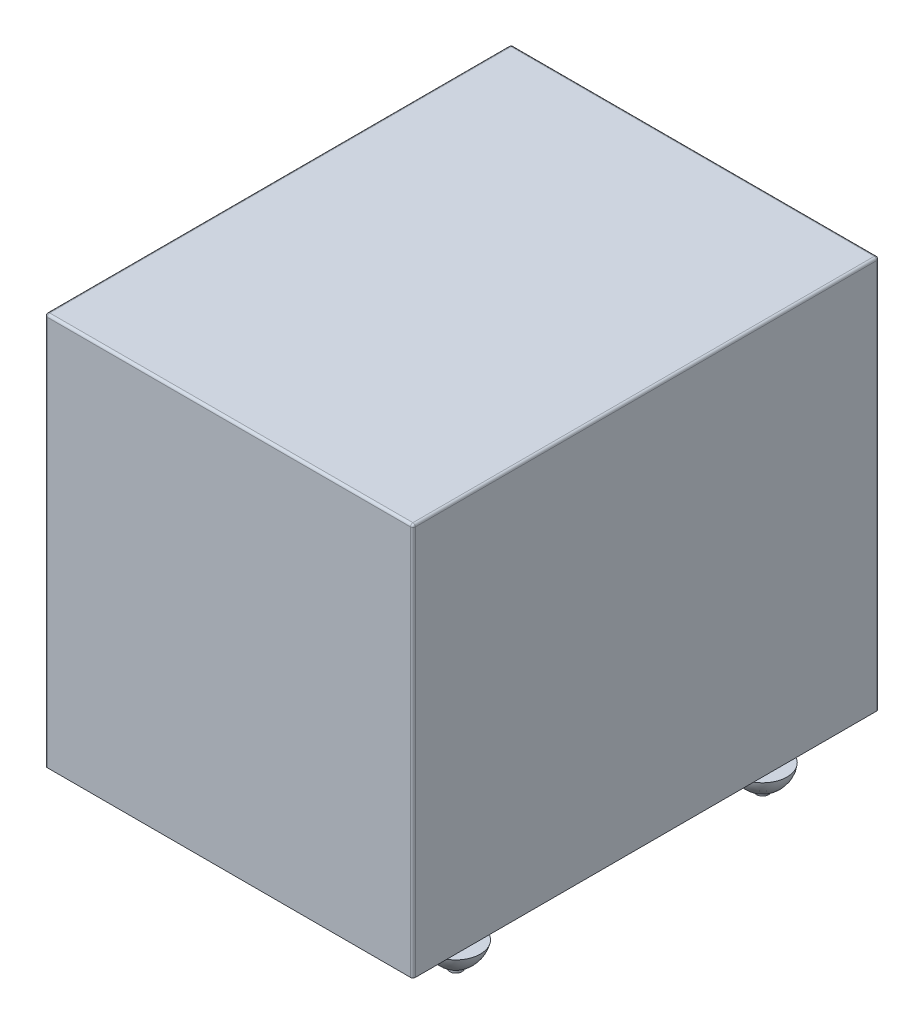
ISO-10303-21;
HEADER;
FILE_DESCRIPTION(('STEP AP214'),'2;1');
FILE_NAME('part.step','',(''),(''),'','','');
FILE_SCHEMA(('AUTOMOTIVE_DESIGN { 1 0 10303 214 1 1 1 1 }'));
ENDSEC;
DATA;
#1=APPLICATION_CONTEXT('core data for automotive mechanical design processes');
#2=APPLICATION_PROTOCOL_DEFINITION('international standard','automotive_design',2000,#1);
#3=PRODUCT_CONTEXT('',#1,'mechanical');
#4=PRODUCT('Part','Part','',(#3));
#5=PRODUCT_RELATED_PRODUCT_CATEGORY('part','',(#4));
#6=PRODUCT_DEFINITION_FORMATION('','',#4);
#7=PRODUCT_DEFINITION_CONTEXT('part definition',#1,'design');
#8=PRODUCT_DEFINITION('design','',#6,#7);
#9=PRODUCT_DEFINITION_SHAPE('','',#8);
#10=(LENGTH_UNIT() NAMED_UNIT(*) SI_UNIT(.MILLI.,.METRE.));
#11=(NAMED_UNIT(*) PLANE_ANGLE_UNIT() SI_UNIT($,.RADIAN.));
#12=(NAMED_UNIT(*) SI_UNIT($,.STERADIAN.) SOLID_ANGLE_UNIT());
#13=UNCERTAINTY_MEASURE_WITH_UNIT(LENGTH_MEASURE(1.E-05),#10,'distance_accuracy_value','');
#14=(GEOMETRIC_REPRESENTATION_CONTEXT(3) GLOBAL_UNCERTAINTY_ASSIGNED_CONTEXT((#13)) GLOBAL_UNIT_ASSIGNED_CONTEXT((#10,
#11,#12)) REPRESENTATION_CONTEXT('',''));
#15=CARTESIAN_POINT('',(0.,0.,0.));
#16=DIRECTION('',(0.,0.,1.));
#17=DIRECTION('',(1.,0.,0.));
#18=AXIS2_PLACEMENT_3D('',#15,#16,#17);
#19=CARTESIAN_POINT('',(6.,-2.,6.25));
#20=DIRECTION('',(0.,1.,0.));
#21=DIRECTION('',(0.,0.,1.));
#22=AXIS2_PLACEMENT_3D('',#19,#20,#21);
#23=CYLINDRICAL_SURFACE('',#22,0.25);
#24=CARTESIAN_POINT('',(6.,0.,6.25));
#25=DIRECTION('',(0.,1.,0.));
#26=DIRECTION('',(0.,0.,1.));
#27=AXIS2_PLACEMENT_3D('',#24,#25,#26);
#28=CIRCLE('',#27,0.25);
#29=CARTESIAN_POINT('',(6.,0.,6.5));
#30=VERTEX_POINT('',#29);
#31=EDGE_CURVE('E187',#30,#30,#28,.F.);
#32=ORIENTED_EDGE('',*,*,#31,.T.);
#33=EDGE_LOOP('',(#32));
#34=FACE_BOUND('',#33,.T.);
#35=CARTESIAN_POINT('',(6.,-1.,6.25));
#36=DIRECTION('',(0.,-1.,0.));
#37=DIRECTION('',(0.,0.,-1.));
#38=AXIS2_PLACEMENT_3D('',#35,#36,#37);
#39=CIRCLE('',#38,0.25);
#40=CARTESIAN_POINT('',(6.,-1.,6.));
#41=VERTEX_POINT('',#40);
#42=EDGE_CURVE('E41',#41,#41,#39,.T.);
#43=ORIENTED_EDGE('',*,*,#42,.F.);
#44=EDGE_LOOP('',(#43));
#45=FACE_BOUND('',#44,.T.);
#46=ADVANCED_FACE('F32',(#34,#45),#23,.T.);
#47=CARTESIAN_POINT('',(7.49999999999999,16.,-9.5));
#48=DIRECTION('',(-1.,0.,0.));
#49=DIRECTION('',(0.,0.,1.));
#50=AXIS2_PLACEMENT_3D('',#47,#48,#49);
#51=PLANE('',#50);
#52=DIRECTION('',(0.,0.,-1.));
#53=VECTOR('',#52,1.);
#54=CARTESIAN_POINT('',(7.49999999999999,0.,-9.5));
#55=LINE('',#54,#53);
#56=CARTESIAN_POINT('',(7.5,0.,9.4));
#57=VERTEX_POINT('',#56);
#58=CARTESIAN_POINT('',(7.49999999999999,0.,-9.4));
#59=VERTEX_POINT('',#58);
#60=EDGE_CURVE('E152',#57,#59,#55,.T.);
#61=ORIENTED_EDGE('',*,*,#60,.T.);
#62=DIRECTION('',(0.,-1.,0.));
#63=VECTOR('',#62,1.);
#64=CARTESIAN_POINT('',(7.49999999999999,16.,-9.4));
#65=LINE('',#64,#63);
#66=CARTESIAN_POINT('',(7.49999999999999,15.9,-9.4));
#67=VERTEX_POINT('',#66);
#68=EDGE_CURVE('E176',#59,#67,#65,.F.);
#69=ORIENTED_EDGE('',*,*,#68,.T.);
#70=DIRECTION('',(0.,0.,-1.));
#71=VECTOR('',#70,1.);
#72=CARTESIAN_POINT('',(7.5,15.9,9.5));
#73=LINE('',#72,#71);
#74=CARTESIAN_POINT('',(7.5,15.9,9.4));
#75=VERTEX_POINT('',#74);
#76=EDGE_CURVE('E172',#67,#75,#73,.F.);
#77=ORIENTED_EDGE('',*,*,#76,.T.);
#78=DIRECTION('',(0.,-1.,0.));
#79=VECTOR('',#78,1.);
#80=CARTESIAN_POINT('',(7.5,16.,9.4));
#81=LINE('',#80,#79);
#82=EDGE_CURVE('E174',#75,#57,#81,.T.);
#83=ORIENTED_EDGE('',*,*,#82,.T.);
#84=EDGE_LOOP('',(#61,#69,#77,#83));
#85=FACE_BOUND('',#84,.T.);
#86=ADVANCED_FACE('F364',(#85),#51,.F.);
#87=CARTESIAN_POINT('',(-7.5,16.,-9.5));
#88=DIRECTION('',(0.,0.,1.));
#89=DIRECTION('',(1.,0.,0.));
#90=AXIS2_PLACEMENT_3D('',#87,#88,#89);
#91=PLANE('',#90);
#92=DIRECTION('',(-1.,0.,0.));
#93=VECTOR('',#92,1.);
#94=CARTESIAN_POINT('',(-7.5,0.,-9.5));
#95=LINE('',#94,#93);
#96=CARTESIAN_POINT('',(7.39999999999999,0.,-9.5));
#97=VERTEX_POINT('',#96);
#98=CARTESIAN_POINT('',(-7.4,0.,-9.5));
#99=VERTEX_POINT('',#98);
#100=EDGE_CURVE('E148',#97,#99,#95,.T.);
#101=ORIENTED_EDGE('',*,*,#100,.T.);
#102=DIRECTION('',(0.,-1.,0.));
#103=VECTOR('',#102,1.);
#104=CARTESIAN_POINT('',(-7.4,16.,-9.5));
#105=LINE('',#104,#103);
#106=CARTESIAN_POINT('',(-7.4,15.9,-9.5));
#107=VERTEX_POINT('',#106);
#108=EDGE_CURVE('E125',#99,#107,#105,.F.);
#109=ORIENTED_EDGE('',*,*,#108,.T.);
#110=DIRECTION('',(-1.,0.,0.));
#111=VECTOR('',#110,1.);
#112=CARTESIAN_POINT('',(7.49999999999999,15.9,-9.5));
#113=LINE('',#112,#111);
#114=CARTESIAN_POINT('',(7.39999999999999,15.9,-9.5));
#115=VERTEX_POINT('',#114);
#116=EDGE_CURVE('E130',#107,#115,#113,.F.);
#117=ORIENTED_EDGE('',*,*,#116,.T.);
#118=DIRECTION('',(0.,-1.,0.));
#119=VECTOR('',#118,1.);
#120=CARTESIAN_POINT('',(7.39999999999999,16.,-9.5));
#121=LINE('',#120,#119);
#122=EDGE_CURVE('E163',#115,#97,#121,.T.);
#123=ORIENTED_EDGE('',*,*,#122,.T.);
#124=EDGE_LOOP('',(#101,#109,#117,#123));
#125=FACE_BOUND('',#124,.T.);
#126=ADVANCED_FACE('F413',(#125),#91,.F.);
#127=CARTESIAN_POINT('',(-7.5,16.,-9.5));
#128=DIRECTION('',(1.,0.,0.));
#129=DIRECTION('',(0.,0.,-1.));
#130=AXIS2_PLACEMENT_3D('',#127,#128,#129);
#131=PLANE('',#130);
#132=DIRECTION('',(0.,0.,1.));
#133=VECTOR('',#132,1.);
#134=CARTESIAN_POINT('',(-7.5,15.9,-9.5));
#135=LINE('',#134,#133);
#136=CARTESIAN_POINT('',(-7.5,15.9,9.4));
#137=VERTEX_POINT('',#136);
#138=CARTESIAN_POINT('',(-7.5,15.9,-9.4));
#139=VERTEX_POINT('',#138);
#140=EDGE_CURVE('E139',#137,#139,#135,.F.);
#141=ORIENTED_EDGE('',*,*,#140,.T.);
#142=DIRECTION('',(0.,-1.,0.));
#143=VECTOR('',#142,1.);
#144=CARTESIAN_POINT('',(-7.5,16.,-9.4));
#145=LINE('',#144,#143);
#146=CARTESIAN_POINT('',(-7.5,0.,-9.4));
#147=VERTEX_POINT('',#146);
#148=EDGE_CURVE('E124',#139,#147,#145,.T.);
#149=ORIENTED_EDGE('',*,*,#148,.T.);
#150=DIRECTION('',(0.,0.,1.));
#151=VECTOR('',#150,1.);
#152=CARTESIAN_POINT('',(-7.5,0.,-9.5));
#153=LINE('',#152,#151);
#154=CARTESIAN_POINT('',(-7.5,0.,9.4));
#155=VERTEX_POINT('',#154);
#156=EDGE_CURVE('E136',#147,#155,#153,.T.);
#157=ORIENTED_EDGE('',*,*,#156,.T.);
#158=DIRECTION('',(0.,-1.,0.));
#159=VECTOR('',#158,1.);
#160=CARTESIAN_POINT('',(-7.5,16.,9.4));
#161=LINE('',#160,#159);
#162=EDGE_CURVE('E142',#155,#137,#161,.F.);
#163=ORIENTED_EDGE('',*,*,#162,.T.);
#164=EDGE_LOOP('',(#141,#149,#157,#163));
#165=FACE_BOUND('',#164,.T.);
#166=ADVANCED_FACE('F135',(#165),#131,.F.);
#167=CARTESIAN_POINT('',(-7.5,16.,9.5));
#168=DIRECTION('',(0.,0.,-1.));
#169=DIRECTION('',(-1.,0.,0.));
#170=AXIS2_PLACEMENT_3D('',#167,#168,#169);
#171=PLANE('',#170);
#172=DIRECTION('',(1.,0.,0.));
#173=VECTOR('',#172,1.);
#174=CARTESIAN_POINT('',(-7.5,15.9,9.5));
#175=LINE('',#174,#173);
#176=CARTESIAN_POINT('',(7.4,15.9,9.5));
#177=VERTEX_POINT('',#176);
#178=CARTESIAN_POINT('',(-7.4,15.9,9.5));
#179=VERTEX_POINT('',#178);
#180=EDGE_CURVE('E166',#177,#179,#175,.F.);
#181=ORIENTED_EDGE('',*,*,#180,.T.);
#182=DIRECTION('',(0.,-1.,0.));
#183=VECTOR('',#182,1.);
#184=CARTESIAN_POINT('',(-7.4,16.,9.5));
#185=LINE('',#184,#183);
#186=CARTESIAN_POINT('',(-7.4,0.,9.5));
#187=VERTEX_POINT('',#186);
#188=EDGE_CURVE('E170',#179,#187,#185,.T.);
#189=ORIENTED_EDGE('',*,*,#188,.T.);
#190=DIRECTION('',(1.,0.,0.));
#191=VECTOR('',#190,1.);
#192=CARTESIAN_POINT('',(-7.5,0.,9.5));
#193=LINE('',#192,#191);
#194=CARTESIAN_POINT('',(7.4,0.,9.5));
#195=VERTEX_POINT('',#194);
#196=EDGE_CURVE('E147',#187,#195,#193,.T.);
#197=ORIENTED_EDGE('',*,*,#196,.T.);
#198=DIRECTION('',(0.,-1.,0.));
#199=VECTOR('',#198,1.);
#200=CARTESIAN_POINT('',(7.4,16.,9.5));
#201=LINE('',#200,#199);
#202=EDGE_CURVE('E168',#195,#177,#201,.F.);
#203=ORIENTED_EDGE('',*,*,#202,.T.);
#204=EDGE_LOOP('',(#181,#189,#197,#203));
#205=FACE_BOUND('',#204,.T.);
#206=ADVANCED_FACE('F395',(#205),#171,.F.);
#207=CARTESIAN_POINT('',(0.,16.,0.));
#208=DIRECTION('',(0.,1.,0.));
#209=DIRECTION('',(0.,0.,1.));
#210=AXIS2_PLACEMENT_3D('',#207,#208,#209);
#211=PLANE('',#210);
#212=DIRECTION('',(-1.,0.,0.));
#213=VECTOR('',#212,1.);
#214=CARTESIAN_POINT('',(-7.5,16.,-9.4));
#215=LINE('',#214,#213);
#216=CARTESIAN_POINT('',(7.39999999999999,16.,-9.4));
#217=VERTEX_POINT('',#216);
#218=CARTESIAN_POINT('',(-7.4,16.,-9.4));
#219=VERTEX_POINT('',#218);
#220=EDGE_CURVE('E182',#217,#219,#215,.T.);
#221=ORIENTED_EDGE('',*,*,#220,.T.);
#222=DIRECTION('',(0.,0.,1.));
#223=VECTOR('',#222,1.);
#224=CARTESIAN_POINT('',(-7.4,16.,9.5));
#225=LINE('',#224,#223);
#226=CARTESIAN_POINT('',(-7.4,16.,9.4));
#227=VERTEX_POINT('',#226);
#228=EDGE_CURVE('E184',#219,#227,#225,.T.);
#229=ORIENTED_EDGE('',*,*,#228,.T.);
#230=DIRECTION('',(1.,0.,0.));
#231=VECTOR('',#230,1.);
#232=CARTESIAN_POINT('',(7.5,16.,9.4));
#233=LINE('',#232,#231);
#234=CARTESIAN_POINT('',(7.4,16.,9.4));
#235=VERTEX_POINT('',#234);
#236=EDGE_CURVE('E178',#227,#235,#233,.T.);
#237=ORIENTED_EDGE('',*,*,#236,.T.);
#238=DIRECTION('',(0.,0.,-1.));
#239=VECTOR('',#238,1.);
#240=CARTESIAN_POINT('',(7.39999999999999,16.,-9.5));
#241=LINE('',#240,#239);
#242=EDGE_CURVE('E180',#235,#217,#241,.T.);
#243=ORIENTED_EDGE('',*,*,#242,.T.);
#244=EDGE_LOOP('',(#221,#229,#237,#243));
#245=FACE_BOUND('',#244,.T.);
#246=ADVANCED_FACE('F621',(#245),#211,.T.);
#247=CARTESIAN_POINT('',(0.,0.,0.));
#248=DIRECTION('',(0.,1.,0.));
#249=DIRECTION('',(0.,0.,1.));
#250=AXIS2_PLACEMENT_3D('',#247,#248,#249);
#251=PLANE('',#250);
#252=CARTESIAN_POINT('',(0.,0.,-8.25));
#253=DIRECTION('',(0.,1.,0.));
#254=DIRECTION('',(0.,0.,1.));
#255=AXIS2_PLACEMENT_3D('',#252,#253,#254);
#256=CIRCLE('',#255,0.25);
#257=CARTESIAN_POINT('',(0.,0.,-8.));
#258=VERTEX_POINT('',#257);
#259=EDGE_CURVE('E234',#258,#258,#256,.F.);
#260=ORIENTED_EDGE('',*,*,#259,.F.);
#261=EDGE_LOOP('',(#260));
#262=FACE_BOUND('',#261,.T.);
#263=CARTESIAN_POINT('',(-6.,0.,-6.25));
#264=DIRECTION('',(0.,1.,0.));
#265=DIRECTION('',(0.,0.,1.));
#266=AXIS2_PLACEMENT_3D('',#263,#264,#265);
#267=CIRCLE('',#266,0.250000000000002);
#268=CARTESIAN_POINT('',(-6.,0.,-6.));
#269=VERTEX_POINT('',#268);
#270=EDGE_CURVE('E231',#269,#269,#267,.F.);
#271=ORIENTED_EDGE('',*,*,#270,.F.);
#272=EDGE_LOOP('',(#271));
#273=FACE_BOUND('',#272,.T.);
#274=CARTESIAN_POINT('',(6.,0.,-6.25));
#275=DIRECTION('',(0.,1.,0.));
#276=DIRECTION('',(0.,0.,1.));
#277=AXIS2_PLACEMENT_3D('',#274,#275,#276);
#278=CIRCLE('',#277,0.249999999999999);
#279=CARTESIAN_POINT('',(6.,0.,-6.));
#280=VERTEX_POINT('',#279);
#281=EDGE_CURVE('E228',#280,#280,#278,.F.);
#282=ORIENTED_EDGE('',*,*,#281,.F.);
#283=EDGE_LOOP('',(#282));
#284=FACE_BOUND('',#283,.T.);
#285=CARTESIAN_POINT('',(-6.,0.,6.25));
#286=DIRECTION('',(0.,1.,0.));
#287=DIRECTION('',(0.,0.,1.));
#288=AXIS2_PLACEMENT_3D('',#285,#286,#287);
#289=CIRCLE('',#288,0.25);
#290=CARTESIAN_POINT('',(-6.,0.,6.5));
#291=VERTEX_POINT('',#290);
#292=EDGE_CURVE('E225',#291,#291,#289,.F.);
#293=ORIENTED_EDGE('',*,*,#292,.F.);
#294=EDGE_LOOP('',(#293));
#295=FACE_BOUND('',#294,.T.);
#296=ORIENTED_EDGE('',*,*,#31,.F.);
#297=EDGE_LOOP('',(#296));
#298=FACE_BOUND('',#297,.T.);
#299=ORIENTED_EDGE('',*,*,#156,.F.);
#300=CARTESIAN_POINT('',(-7.4,0.,-9.4));
#301=DIRECTION('',(0.,1.,0.));
#302=DIRECTION('',(0.,0.,1.));
#303=AXIS2_PLACEMENT_3D('',#300,#301,#302);
#304=CIRCLE('',#303,0.1);
#305=EDGE_CURVE('E120',#147,#99,#304,.F.);
#306=ORIENTED_EDGE('',*,*,#305,.T.);
#307=ORIENTED_EDGE('',*,*,#100,.F.);
#308=CARTESIAN_POINT('',(7.39999999999999,0.,-9.4));
#309=DIRECTION('',(0.,1.,0.));
#310=DIRECTION('',(0.,0.,1.));
#311=AXIS2_PLACEMENT_3D('',#308,#309,#310);
#312=CIRCLE('',#311,0.1);
#313=EDGE_CURVE('E159',#97,#59,#312,.F.);
#314=ORIENTED_EDGE('',*,*,#313,.T.);
#315=ORIENTED_EDGE('',*,*,#60,.F.);
#316=CARTESIAN_POINT('',(7.4,0.,9.4));
#317=DIRECTION('',(0.,1.,0.));
#318=DIRECTION('',(0.,0.,1.));
#319=AXIS2_PLACEMENT_3D('',#316,#317,#318);
#320=CIRCLE('',#319,0.1);
#321=EDGE_CURVE('E141',#57,#195,#320,.F.);
#322=ORIENTED_EDGE('',*,*,#321,.T.);
#323=ORIENTED_EDGE('',*,*,#196,.F.);
#324=CARTESIAN_POINT('',(-7.4,0.,9.4));
#325=DIRECTION('',(0.,1.,0.));
#326=DIRECTION('',(0.,0.,1.));
#327=AXIS2_PLACEMENT_3D('',#324,#325,#326);
#328=CIRCLE('',#327,0.1);
#329=EDGE_CURVE('E131',#187,#155,#328,.F.);
#330=ORIENTED_EDGE('',*,*,#329,.T.);
#331=EDGE_LOOP('',(#299,#306,#307,#314,#315,#322,#323,#330));
#332=FACE_BOUND('',#331,.T.);
#333=ADVANCED_FACE('F144',(#262,#273,#284,#295,#298,#332),#251,.F.);
#334=CARTESIAN_POINT('',(7.4,16.,9.4));
#335=DIRECTION('',(0.,-1.,0.));
#336=DIRECTION('',(0.,0.,-1.));
#337=AXIS2_PLACEMENT_3D('',#334,#335,#336);
#338=CYLINDRICAL_SURFACE('',#337,0.1);
#339=CARTESIAN_POINT('',(7.4,15.9,9.4));
#340=DIRECTION('',(0.,1.,0.));
#341=DIRECTION('',(0.,0.,1.));
#342=AXIS2_PLACEMENT_3D('',#339,#340,#341);
#343=CIRCLE('',#342,0.1);
#344=EDGE_CURVE('E220',#177,#75,#343,.T.);
#345=ORIENTED_EDGE('',*,*,#344,.F.);
#346=ORIENTED_EDGE('',*,*,#202,.F.);
#347=ORIENTED_EDGE('',*,*,#321,.F.);
#348=ORIENTED_EDGE('',*,*,#82,.F.);
#349=EDGE_LOOP('',(#345,#346,#347,#348));
#350=FACE_BOUND('',#349,.T.);
#351=ADVANCED_FACE('F34',(#350),#338,.T.);
#352=CARTESIAN_POINT('',(7.4,15.9,9.4));
#353=DIRECTION('',(0.,0.,1.));
#354=DIRECTION('',(1.,0.,0.));
#355=AXIS2_PLACEMENT_3D('',#352,#353,#354);
#356=SPHERICAL_SURFACE('',#355,0.1);
#357=CARTESIAN_POINT('',(7.4,15.9,9.4));
#358=DIRECTION('',(1.,0.,0.));
#359=DIRECTION('',(0.,0.,-1.));
#360=AXIS2_PLACEMENT_3D('',#357,#358,#359);
#361=CIRCLE('',#360,0.1);
#362=EDGE_CURVE('E214',#177,#235,#361,.F.);
#363=ORIENTED_EDGE('',*,*,#362,.F.);
#364=ORIENTED_EDGE('',*,*,#344,.T.);
#365=CARTESIAN_POINT('',(7.4,15.9,9.4));
#366=DIRECTION('',(0.,0.,1.));
#367=DIRECTION('',(1.,0.,0.));
#368=AXIS2_PLACEMENT_3D('',#365,#366,#367);
#369=CIRCLE('',#368,0.1);
#370=EDGE_CURVE('E217',#235,#75,#369,.F.);
#371=ORIENTED_EDGE('',*,*,#370,.F.);
#372=EDGE_LOOP('',(#363,#364,#371));
#373=FACE_BOUND('',#372,.T.);
#374=ADVANCED_FACE('F387',(#373),#356,.T.);
#375=CARTESIAN_POINT('',(7.39999999999999,16.,-9.4));
#376=DIRECTION('',(0.,-1.,0.));
#377=DIRECTION('',(0.,0.,-1.));
#378=AXIS2_PLACEMENT_3D('',#375,#376,#377);
#379=CYLINDRICAL_SURFACE('',#378,0.1);
#380=ORIENTED_EDGE('',*,*,#313,.F.);
#381=ORIENTED_EDGE('',*,*,#122,.F.);
#382=CARTESIAN_POINT('',(7.39999999999999,15.9,-9.4));
#383=DIRECTION('',(0.,1.,0.));
#384=DIRECTION('',(0.,0.,1.));
#385=AXIS2_PLACEMENT_3D('',#382,#383,#384);
#386=CIRCLE('',#385,0.1);
#387=EDGE_CURVE('E211',#67,#115,#386,.T.);
#388=ORIENTED_EDGE('',*,*,#387,.F.);
#389=ORIENTED_EDGE('',*,*,#68,.F.);
#390=EDGE_LOOP('',(#380,#381,#388,#389));
#391=FACE_BOUND('',#390,.T.);
#392=ADVANCED_FACE('F371',(#391),#379,.T.);
#393=CARTESIAN_POINT('',(7.4,15.9,0.));
#394=DIRECTION('',(0.,0.,1.));
#395=DIRECTION('',(1.,0.,0.));
#396=AXIS2_PLACEMENT_3D('',#393,#394,#395);
#397=CYLINDRICAL_SURFACE('',#396,0.1);
#398=ORIENTED_EDGE('',*,*,#370,.T.);
#399=ORIENTED_EDGE('',*,*,#76,.F.);
#400=CARTESIAN_POINT('',(7.39999999999999,15.9,-9.4));
#401=DIRECTION('',(0.,0.,-1.));
#402=DIRECTION('',(-1.,0.,0.));
#403=AXIS2_PLACEMENT_3D('',#400,#401,#402);
#404=CIRCLE('',#403,0.1);
#405=EDGE_CURVE('E208',#217,#67,#404,.T.);
#406=ORIENTED_EDGE('',*,*,#405,.F.);
#407=ORIENTED_EDGE('',*,*,#242,.F.);
#408=EDGE_LOOP('',(#398,#399,#406,#407));
#409=FACE_BOUND('',#408,.T.);
#410=ADVANCED_FACE('F380',(#409),#397,.T.);
#411=CARTESIAN_POINT('',(0.,15.9,9.4));
#412=DIRECTION('',(-1.,0.,0.));
#413=DIRECTION('',(0.,0.,1.));
#414=AXIS2_PLACEMENT_3D('',#411,#412,#413);
#415=CYLINDRICAL_SURFACE('',#414,0.1);
#416=ORIENTED_EDGE('',*,*,#362,.T.);
#417=ORIENTED_EDGE('',*,*,#236,.F.);
#418=CARTESIAN_POINT('',(-7.4,15.9,9.4));
#419=DIRECTION('',(-1.,0.,0.));
#420=DIRECTION('',(0.,0.,1.));
#421=AXIS2_PLACEMENT_3D('',#418,#419,#420);
#422=CIRCLE('',#421,0.1);
#423=EDGE_CURVE('E205',#179,#227,#422,.T.);
#424=ORIENTED_EDGE('',*,*,#423,.F.);
#425=ORIENTED_EDGE('',*,*,#180,.F.);
#426=EDGE_LOOP('',(#416,#417,#424,#425));
#427=FACE_BOUND('',#426,.T.);
#428=ADVANCED_FACE('F392',(#427),#415,.T.);
#429=CARTESIAN_POINT('',(-7.4,16.,9.4));
#430=DIRECTION('',(0.,-1.,0.));
#431=DIRECTION('',(0.,0.,-1.));
#432=AXIS2_PLACEMENT_3D('',#429,#430,#431);
#433=CYLINDRICAL_SURFACE('',#432,0.1);
#434=ORIENTED_EDGE('',*,*,#329,.F.);
#435=ORIENTED_EDGE('',*,*,#188,.F.);
#436=CARTESIAN_POINT('',(-7.4,15.9,9.4));
#437=DIRECTION('',(0.,1.,0.));
#438=DIRECTION('',(0.,0.,1.));
#439=AXIS2_PLACEMENT_3D('',#436,#437,#438);
#440=CIRCLE('',#439,0.1);
#441=EDGE_CURVE('E202',#137,#179,#440,.T.);
#442=ORIENTED_EDGE('',*,*,#441,.F.);
#443=ORIENTED_EDGE('',*,*,#162,.F.);
#444=EDGE_LOOP('',(#434,#435,#442,#443));
#445=FACE_BOUND('',#444,.T.);
#446=ADVANCED_FACE('F398',(#445),#433,.T.);
#447=CARTESIAN_POINT('',(7.39999999999999,15.9,-9.4));
#448=DIRECTION('',(0.,0.,1.));
#449=DIRECTION('',(1.,0.,0.));
#450=AXIS2_PLACEMENT_3D('',#447,#448,#449);
#451=SPHERICAL_SURFACE('',#450,0.1);
#452=ORIENTED_EDGE('',*,*,#405,.T.);
#453=ORIENTED_EDGE('',*,*,#387,.T.);
#454=CARTESIAN_POINT('',(7.39999999999999,15.9,-9.4));
#455=DIRECTION('',(1.,0.,0.));
#456=DIRECTION('',(0.,1.,0.));
#457=AXIS2_PLACEMENT_3D('',#454,#455,#456);
#458=CIRCLE('',#457,0.1);
#459=EDGE_CURVE('E199',#217,#115,#458,.F.);
#460=ORIENTED_EDGE('',*,*,#459,.F.);
#461=EDGE_LOOP('',(#452,#453,#460));
#462=FACE_BOUND('',#461,.T.);
#463=ADVANCED_FACE('F376',(#462),#451,.T.);
#464=CARTESIAN_POINT('',(-7.4,15.9,9.4));
#465=DIRECTION('',(0.,0.,1.));
#466=DIRECTION('',(1.,0.,0.));
#467=AXIS2_PLACEMENT_3D('',#464,#465,#466);
#468=SPHERICAL_SURFACE('',#467,0.1);
#469=ORIENTED_EDGE('',*,*,#441,.T.);
#470=ORIENTED_EDGE('',*,*,#423,.T.);
#471=CARTESIAN_POINT('',(-7.4,15.9,9.4));
#472=DIRECTION('',(0.,0.,1.));
#473=DIRECTION('',(1.,0.,0.));
#474=AXIS2_PLACEMENT_3D('',#471,#472,#473);
#475=CIRCLE('',#474,0.1);
#476=EDGE_CURVE('E197',#137,#227,#475,.F.);
#477=ORIENTED_EDGE('',*,*,#476,.F.);
#478=EDGE_LOOP('',(#469,#470,#477));
#479=FACE_BOUND('',#478,.T.);
#480=ADVANCED_FACE('F401',(#479),#468,.T.);
#481=CARTESIAN_POINT('',(0.,15.9,-9.4));
#482=DIRECTION('',(1.,0.,0.));
#483=DIRECTION('',(0.,0.,-1.));
#484=AXIS2_PLACEMENT_3D('',#481,#482,#483);
#485=CYLINDRICAL_SURFACE('',#484,0.1);
#486=ORIENTED_EDGE('',*,*,#459,.T.);
#487=ORIENTED_EDGE('',*,*,#116,.F.);
#488=CARTESIAN_POINT('',(-7.4,15.9,-9.4));
#489=DIRECTION('',(-1.,0.,0.));
#490=DIRECTION('',(0.,0.,1.));
#491=AXIS2_PLACEMENT_3D('',#488,#489,#490);
#492=CIRCLE('',#491,0.1);
#493=EDGE_CURVE('E194',#219,#107,#492,.T.);
#494=ORIENTED_EDGE('',*,*,#493,.F.);
#495=ORIENTED_EDGE('',*,*,#220,.F.);
#496=EDGE_LOOP('',(#486,#487,#494,#495));
#497=FACE_BOUND('',#496,.T.);
#498=ADVANCED_FACE('F411',(#497),#485,.T.);
#499=CARTESIAN_POINT('',(-7.4,15.9,0.));
#500=DIRECTION('',(0.,0.,-1.));
#501=DIRECTION('',(-1.,0.,0.));
#502=AXIS2_PLACEMENT_3D('',#499,#500,#501);
#503=CYLINDRICAL_SURFACE('',#502,0.1);
#504=ORIENTED_EDGE('',*,*,#476,.T.);
#505=ORIENTED_EDGE('',*,*,#228,.F.);
#506=CARTESIAN_POINT('',(-7.4,15.9,-9.4));
#507=DIRECTION('',(0.,0.,-1.));
#508=DIRECTION('',(-1.,0.,0.));
#509=AXIS2_PLACEMENT_3D('',#506,#507,#508);
#510=CIRCLE('',#509,0.1);
#511=EDGE_CURVE('E190',#139,#219,#510,.T.);
#512=ORIENTED_EDGE('',*,*,#511,.F.);
#513=ORIENTED_EDGE('',*,*,#140,.F.);
#514=EDGE_LOOP('',(#504,#505,#512,#513));
#515=FACE_BOUND('',#514,.T.);
#516=ADVANCED_FACE('F404',(#515),#503,.T.);
#517=CARTESIAN_POINT('',(-7.4,15.9,-9.4));
#518=DIRECTION('',(0.,0.,1.));
#519=DIRECTION('',(1.,0.,0.));
#520=AXIS2_PLACEMENT_3D('',#517,#518,#519);
#521=SPHERICAL_SURFACE('',#520,0.1);
#522=ORIENTED_EDGE('',*,*,#511,.T.);
#523=ORIENTED_EDGE('',*,*,#493,.T.);
#524=CARTESIAN_POINT('',(-7.4,15.9,-9.4));
#525=DIRECTION('',(0.,1.,0.));
#526=DIRECTION('',(0.,0.,1.));
#527=AXIS2_PLACEMENT_3D('',#524,#525,#526);
#528=CIRCLE('',#527,0.1);
#529=EDGE_CURVE('E188',#139,#107,#528,.F.);
#530=ORIENTED_EDGE('',*,*,#529,.F.);
#531=EDGE_LOOP('',(#522,#523,#530));
#532=FACE_BOUND('',#531,.T.);
#533=ADVANCED_FACE('F408',(#532),#521,.T.);
#534=CARTESIAN_POINT('',(-7.4,16.,-9.4));
#535=DIRECTION('',(0.,-1.,0.));
#536=DIRECTION('',(0.,0.,-1.));
#537=AXIS2_PLACEMENT_3D('',#534,#535,#536);
#538=CYLINDRICAL_SURFACE('',#537,0.1);
#539=ORIENTED_EDGE('',*,*,#529,.T.);
#540=ORIENTED_EDGE('',*,*,#108,.F.);
#541=ORIENTED_EDGE('',*,*,#305,.F.);
#542=ORIENTED_EDGE('',*,*,#148,.F.);
#543=EDGE_LOOP('',(#539,#540,#541,#542));
#544=FACE_BOUND('',#543,.T.);
#545=ADVANCED_FACE('F123',(#544),#538,.T.);
#546=CARTESIAN_POINT('',(-6.,-2.,6.25));
#547=DIRECTION('',(0.,1.,0.));
#548=DIRECTION('',(0.,0.,1.));
#549=AXIS2_PLACEMENT_3D('',#546,#547,#548);
#550=CYLINDRICAL_SURFACE('',#549,0.25);
#551=CARTESIAN_POINT('',(-6.,-1.,6.25));
#552=DIRECTION('',(0.,1.,0.));
#553=DIRECTION('',(0.,0.,1.));
#554=AXIS2_PLACEMENT_3D('',#551,#552,#553);
#555=CIRCLE('',#554,0.25);
#556=CARTESIAN_POINT('',(-6.,-1.,6.5));
#557=VERTEX_POINT('',#556);
#558=EDGE_CURVE('E245',#557,#557,#555,.T.);
#559=ORIENTED_EDGE('',*,*,#558,.T.);
#560=EDGE_LOOP('',(#559));
#561=FACE_BOUND('',#560,.T.);
#562=ORIENTED_EDGE('',*,*,#292,.T.);
#563=EDGE_LOOP('',(#562));
#564=FACE_BOUND('',#563,.T.);
#565=ADVANCED_FACE('F444',(#561,#564),#550,.T.);
#566=CARTESIAN_POINT('',(6.,-2.,-6.25));
#567=DIRECTION('',(0.,1.,0.));
#568=DIRECTION('',(0.,0.,1.));
#569=AXIS2_PLACEMENT_3D('',#566,#567,#568);
#570=CYLINDRICAL_SURFACE('',#569,0.249999999999999);
#571=CARTESIAN_POINT('',(6.,-0.999999999999999,-6.25));
#572=DIRECTION('',(0.,1.,0.));
#573=DIRECTION('',(0.,0.,1.));
#574=AXIS2_PLACEMENT_3D('',#571,#572,#573);
#575=CIRCLE('',#574,0.249999999999999);
#576=CARTESIAN_POINT('',(6.,-0.999999999999999,-6.));
#577=VERTEX_POINT('',#576);
#578=EDGE_CURVE('E254',#577,#577,#575,.T.);
#579=ORIENTED_EDGE('',*,*,#578,.T.);
#580=EDGE_LOOP('',(#579));
#581=FACE_BOUND('',#580,.T.);
#582=ORIENTED_EDGE('',*,*,#281,.T.);
#583=EDGE_LOOP('',(#582));
#584=FACE_BOUND('',#583,.T.);
#585=ADVANCED_FACE('F447',(#581,#584),#570,.T.);
#586=CARTESIAN_POINT('',(-6.,-2.,-6.25));
#587=DIRECTION('',(0.,1.,0.));
#588=DIRECTION('',(0.,0.,1.));
#589=AXIS2_PLACEMENT_3D('',#586,#587,#588);
#590=CYLINDRICAL_SURFACE('',#589,0.250000000000002);
#591=CARTESIAN_POINT('',(-6.,-1.,-6.25));
#592=DIRECTION('',(0.,1.,0.));
#593=DIRECTION('',(0.,0.,1.));
#594=AXIS2_PLACEMENT_3D('',#591,#592,#593);
#595=CIRCLE('',#594,0.250000000000002);
#596=CARTESIAN_POINT('',(-6.,-1.,-6.));
#597=VERTEX_POINT('',#596);
#598=EDGE_CURVE('E237',#597,#597,#595,.T.);
#599=ORIENTED_EDGE('',*,*,#598,.T.);
#600=EDGE_LOOP('',(#599));
#601=FACE_BOUND('',#600,.T.);
#602=ORIENTED_EDGE('',*,*,#270,.T.);
#603=EDGE_LOOP('',(#602));
#604=FACE_BOUND('',#603,.T.);
#605=ADVANCED_FACE('F455',(#601,#604),#590,.T.);
#606=CARTESIAN_POINT('',(0.,-2.,-8.25));
#607=DIRECTION('',(0.,1.,0.));
#608=DIRECTION('',(0.,0.,1.));
#609=AXIS2_PLACEMENT_3D('',#606,#607,#608);
#610=CYLINDRICAL_SURFACE('',#609,0.25);
#611=CARTESIAN_POINT('',(0.,-1.,-8.25));
#612=DIRECTION('',(0.,1.,0.));
#613=DIRECTION('',(0.,0.,1.));
#614=AXIS2_PLACEMENT_3D('',#611,#612,#613);
#615=CIRCLE('',#614,0.25);
#616=CARTESIAN_POINT('',(0.,-1.,-8.));
#617=VERTEX_POINT('',#616);
#618=EDGE_CURVE('E261',#617,#617,#615,.T.);
#619=ORIENTED_EDGE('',*,*,#618,.T.);
#620=EDGE_LOOP('',(#619));
#621=FACE_BOUND('',#620,.T.);
#622=ORIENTED_EDGE('',*,*,#259,.T.);
#623=EDGE_LOOP('',(#622));
#624=FACE_BOUND('',#623,.T.);
#625=ADVANCED_FACE('F335',(#621,#624),#610,.T.);
#626=CARTESIAN_POINT('',(-6.,-2.,-6.25));
#627=CARTESIAN_POINT('',(-6.,-1.62839039192073,-5.44003817454615));
#628=CARTESIAN_POINT('',(-6.,-1.,-5.25));
#629=B_SPLINE_CURVE_WITH_KNOTS('',2,(#626,#627,#628),.UNSPECIFIED.,.F.,.F.,(3,3),(0.,
0.619923650907754),.UNSPECIFIED.);
#630=CARTESIAN_POINT('',(-6.,-2.,-6.25));
#631=DIRECTION('',(0.,-1.,0.));
#632=AXIS1_PLACEMENT('',#630,#631);
#633=SURFACE_OF_REVOLUTION('',#629,#632);
#634=CARTESIAN_POINT('',(-6.,-1.,-6.25));
#635=DIRECTION('',(0.,-1.,0.));
#636=DIRECTION('',(0.,0.,-1.));
#637=AXIS2_PLACEMENT_3D('',#634,#635,#636);
#638=CIRCLE('',#637,1.);
#639=CARTESIAN_POINT('',(-6.,-1.,-7.25));
#640=VERTEX_POINT('',#639);
#641=EDGE_CURVE('E241',#640,#640,#638,.T.);
#642=ORIENTED_EDGE('',*,*,#641,.T.);
#643=EDGE_LOOP('',(#642));
#644=FACE_BOUND('',#643,.T.);
#645=CARTESIAN_POINT('',(-6.,-1.87061775298902,-6.25));
#646=DIRECTION('',(0.,-1.,0.));
#647=DIRECTION('',(0.,0.,-1.));
#648=AXIS2_PLACEMENT_3D('',#645,#646,#647);
#649=CIRCLE('',#648,0.250000000000002);
#650=CARTESIAN_POINT('',(-6.,-1.87061775298902,-6.5));
#651=VERTEX_POINT('',#650);
#652=EDGE_CURVE('E240',#651,#651,#649,.T.);
#653=ORIENTED_EDGE('',*,*,#652,.F.);
#654=EDGE_LOOP('',(#653));
#655=FACE_BOUND('',#654,.T.);
#656=ADVANCED_FACE('F331',(#644,#655),#633,.F.);
#657=CARTESIAN_POINT('',(-6.,-1.,-6.25));
#658=DIRECTION('',(0.,1.,0.));
#659=DIRECTION('',(0.,0.,1.));
#660=AXIS2_PLACEMENT_3D('',#657,#658,#659);
#661=PLANE('',#660);
#662=ORIENTED_EDGE('',*,*,#598,.F.);
#663=EDGE_LOOP('',(#662));
#664=FACE_BOUND('',#663,.T.);
#665=ORIENTED_EDGE('',*,*,#641,.F.);
#666=EDGE_LOOP('',(#665));
#667=FACE_BOUND('',#666,.T.);
#668=ADVANCED_FACE('F327',(#664,#667),#661,.T.);
#669=CARTESIAN_POINT('',(-6.,-2.,-6.25));
#670=DIRECTION('',(0.,-1.,0.));
#671=DIRECTION('',(0.,0.,-1.));
#672=AXIS2_PLACEMENT_3D('',#669,#670,#671);
#673=PLANE('',#672);
#674=CARTESIAN_POINT('',(-6.,-2.,-6.25));
#675=VERTEX_POINT('',#674);
#676=VERTEX_LOOP('',#675);
#677=FACE_BOUND('',#676,.T.);
#678=CARTESIAN_POINT('',(-6.,-2.,-6.25));
#679=DIRECTION('',(0.,-1.,0.));
#680=DIRECTION('',(0.,0.,-1.));
#681=AXIS2_PLACEMENT_3D('',#678,#679,#680);
#682=CIRCLE('',#681,0.250000000000002);
#683=CARTESIAN_POINT('',(-6.,-2.,-6.5));
#684=VERTEX_POINT('',#683);
#685=EDGE_CURVE('E350',#684,#684,#682,.T.);
#686=ORIENTED_EDGE('',*,*,#685,.T.);
#687=EDGE_LOOP('',(#686));
#688=FACE_BOUND('',#687,.T.);
#689=ADVANCED_FACE('F330',(#677,#688),#673,.T.);
#690=ORIENTED_EDGE('',*,*,#652,.T.);
#691=EDGE_LOOP('',(#690));
#692=FACE_BOUND('',#691,.T.);
#693=ORIENTED_EDGE('',*,*,#685,.F.);
#694=EDGE_LOOP('',(#693));
#695=FACE_BOUND('',#694,.T.);
#696=ADVANCED_FACE('F325',(#692,#695),#590,.T.);
#697=CARTESIAN_POINT('',(-6.,-2.,6.25));
#698=CARTESIAN_POINT('',(-6.,-1.6303981095737,7.06480888464154));
#699=CARTESIAN_POINT('',(-6.,-1.,7.25));
#700=B_SPLINE_CURVE_WITH_KNOTS('',2,(#697,#698,#699),.UNSPECIFIED.,.F.,.F.,(3,3),(0.,
0.629617769283207),.UNSPECIFIED.);
#701=CARTESIAN_POINT('',(-6.,-2.,6.25));
#702=DIRECTION('',(0.,-1.,0.));
#703=AXIS1_PLACEMENT('',#701,#702);
#704=SURFACE_OF_REVOLUTION('',#700,#703);
#705=CARTESIAN_POINT('',(-6.,-1.,6.25));
#706=DIRECTION('',(0.,-1.,0.));
#707=DIRECTION('',(0.,0.,-1.));
#708=AXIS2_PLACEMENT_3D('',#705,#706,#707);
#709=CIRCLE('',#708,1.);
#710=CARTESIAN_POINT('',(-6.,-1.,5.25));
#711=VERTEX_POINT('',#710);
#712=EDGE_CURVE('E249',#711,#711,#709,.T.);
#713=ORIENTED_EDGE('',*,*,#712,.T.);
#714=EDGE_LOOP('',(#713));
#715=FACE_BOUND('',#714,.T.);
#716=CARTESIAN_POINT('',(-6.,-1.8719434303823,6.25));
#717=DIRECTION('',(0.,-1.,0.));
#718=DIRECTION('',(0.,0.,-1.));
#719=AXIS2_PLACEMENT_3D('',#716,#717,#718);
#720=CIRCLE('',#719,0.250000000000001);
#721=CARTESIAN_POINT('',(-6.,-1.8719434303823,6.));
#722=VERTEX_POINT('',#721);
#723=EDGE_CURVE('E248',#722,#722,#720,.T.);
#724=ORIENTED_EDGE('',*,*,#723,.F.);
#725=EDGE_LOOP('',(#724));
#726=FACE_BOUND('',#725,.T.);
#727=ADVANCED_FACE('F322',(#715,#726),#704,.F.);
#728=CARTESIAN_POINT('',(-6.,-1.,6.25));
#729=DIRECTION('',(0.,1.,0.));
#730=DIRECTION('',(0.,0.,1.));
#731=AXIS2_PLACEMENT_3D('',#728,#729,#730);
#732=PLANE('',#731);
#733=ORIENTED_EDGE('',*,*,#558,.F.);
#734=EDGE_LOOP('',(#733));
#735=FACE_BOUND('',#734,.T.);
#736=ORIENTED_EDGE('',*,*,#712,.F.);
#737=EDGE_LOOP('',(#736));
#738=FACE_BOUND('',#737,.T.);
#739=ADVANCED_FACE('F303',(#735,#738),#732,.T.);
#740=CARTESIAN_POINT('',(-6.,-2.,6.25));
#741=DIRECTION('',(0.,1.,0.));
#742=DIRECTION('',(0.,0.,1.));
#743=AXIS2_PLACEMENT_3D('',#740,#741,#742);
#744=PLANE('',#743);
#745=CARTESIAN_POINT('',(-6.,-2.,6.25));
#746=VERTEX_POINT('',#745);
#747=VERTEX_LOOP('',#746);
#748=FACE_BOUND('',#747,.T.);
#749=CARTESIAN_POINT('',(-6.,-2.,6.25));
#750=DIRECTION('',(0.,-1.,0.));
#751=DIRECTION('',(0.,0.,1.));
#752=AXIS2_PLACEMENT_3D('',#749,#750,#751);
#753=CIRCLE('',#752,0.25);
#754=CARTESIAN_POINT('',(-6.,-2.,6.5));
#755=VERTEX_POINT('',#754);
#756=EDGE_CURVE('E356',#755,#755,#753,.T.);
#757=ORIENTED_EDGE('',*,*,#756,.T.);
#758=EDGE_LOOP('',(#757));
#759=FACE_BOUND('',#758,.T.);
#760=ADVANCED_FACE('F449',(#748,#759),#744,.F.);
#761=ORIENTED_EDGE('',*,*,#723,.T.);
#762=EDGE_LOOP('',(#761));
#763=FACE_BOUND('',#762,.T.);
#764=ORIENTED_EDGE('',*,*,#756,.F.);
#765=EDGE_LOOP('',(#764));
#766=FACE_BOUND('',#765,.T.);
#767=ADVANCED_FACE('F301',(#763,#766),#550,.T.);
#768=CARTESIAN_POINT('',(6.,-1.,7.25));
#769=CARTESIAN_POINT('',(6.,-1.64841356490774,7.10830204123841));
#770=CARTESIAN_POINT('',(6.,-2.,6.25));
#771=B_SPLINE_CURVE_WITH_KNOTS('',2,(#768,#769,#770),.UNSPECIFIED.,.F.,.F.,(3,3),(0.,
0.716604082476312),.UNSPECIFIED.);
#772=CARTESIAN_POINT('',(6.,-2.,6.25));
#773=DIRECTION('',(0.,-1.,0.));
#774=AXIS1_PLACEMENT('',#772,#773);
#775=SURFACE_OF_REVOLUTION('',#771,#774);
#776=CARTESIAN_POINT('',(6.,-1.,6.25));
#777=DIRECTION('',(0.,-1.,0.));
#778=DIRECTION('',(0.,0.,-1.));
#779=AXIS2_PLACEMENT_3D('',#776,#777,#778);
#780=CIRCLE('',#779,1.);
#781=CARTESIAN_POINT('',(6.,-1.,5.25));
#782=VERTEX_POINT('',#781);
#783=EDGE_CURVE('E260',#782,#782,#780,.T.);
#784=ORIENTED_EDGE('',*,*,#783,.T.);
#785=EDGE_LOOP('',(#784));
#786=FACE_BOUND('',#785,.T.);
#787=CARTESIAN_POINT('',(6.,-1.88326847167419,6.25));
#788=DIRECTION('',(0.,-1.,0.));
#789=DIRECTION('',(0.,0.,-1.));
#790=AXIS2_PLACEMENT_3D('',#787,#788,#789);
#791=CIRCLE('',#790,0.250000000000001);
#792=CARTESIAN_POINT('',(6.,-1.88326847167419,6.));
#793=VERTEX_POINT('',#792);
#794=EDGE_CURVE('E11',#793,#793,#791,.F.);
#795=ORIENTED_EDGE('',*,*,#794,.T.);
#796=EDGE_LOOP('',(#795));
#797=FACE_BOUND('',#796,.T.);
#798=ADVANCED_FACE('F297',(#786,#797),#775,.T.);
#799=CARTESIAN_POINT('',(6.,-1.,6.25));
#800=DIRECTION('',(0.,-1.,0.));
#801=DIRECTION('',(0.,0.,-1.));
#802=AXIS2_PLACEMENT_3D('',#799,#800,#801);
#803=PLANE('',#802);
#804=ORIENTED_EDGE('',*,*,#42,.T.);
#805=EDGE_LOOP('',(#804));
#806=FACE_BOUND('',#805,.T.);
#807=ORIENTED_EDGE('',*,*,#783,.F.);
#808=EDGE_LOOP('',(#807));
#809=FACE_BOUND('',#808,.T.);
#810=ADVANCED_FACE('F293',(#806,#809),#803,.F.);
#811=CARTESIAN_POINT('',(6.,-2.,6.25));
#812=DIRECTION('',(0.,-1.,0.));
#813=DIRECTION('',(0.,0.,-1.));
#814=AXIS2_PLACEMENT_3D('',#811,#812,#813);
#815=PLANE('',#814);
#816=CARTESIAN_POINT('',(6.,-2.,6.25));
#817=VERTEX_POINT('',#816);
#818=VERTEX_LOOP('',#817);
#819=FACE_BOUND('',#818,.T.);
#820=CARTESIAN_POINT('',(6.,-2.,6.25));
#821=DIRECTION('',(0.,-1.,0.));
#822=DIRECTION('',(0.,0.,-1.));
#823=AXIS2_PLACEMENT_3D('',#820,#821,#822);
#824=CIRCLE('',#823,0.25);
#825=CARTESIAN_POINT('',(6.,-2.,6.));
#826=VERTEX_POINT('',#825);
#827=EDGE_CURVE('E191',#826,#826,#824,.T.);
#828=ORIENTED_EDGE('',*,*,#827,.T.);
#829=EDGE_LOOP('',(#828));
#830=FACE_BOUND('',#829,.T.);
#831=ADVANCED_FACE('F296',(#819,#830),#815,.T.);
#832=ORIENTED_EDGE('',*,*,#827,.F.);
#833=EDGE_LOOP('',(#832));
#834=FACE_BOUND('',#833,.T.);
#835=ORIENTED_EDGE('',*,*,#794,.F.);
#836=EDGE_LOOP('',(#835));
#837=FACE_BOUND('',#836,.T.);
#838=ADVANCED_FACE('F290',(#834,#837),#23,.T.);
#839=CARTESIAN_POINT('',(5.99999999999999,-2.,-6.25));
#840=CARTESIAN_POINT('',(5.99999999999999,-1.67362202210002,-7.16916064044728));
#841=CARTESIAN_POINT('',(5.99999999999999,-1.,-7.25));
#842=B_SPLINE_CURVE_WITH_KNOTS('',2,(#839,#840,#841),.UNSPECIFIED.,.F.,.F.,(3,3),(0.,
0.838321280881377),.UNSPECIFIED.);
#843=CARTESIAN_POINT('',(5.99999999999999,-2.,-6.25));
#844=DIRECTION('',(0.,-1.,0.));
#845=AXIS1_PLACEMENT('',#843,#844);
#846=SURFACE_OF_REVOLUTION('',#842,#845);
#847=CARTESIAN_POINT('',(5.99999999999999,-0.999999999999999,-6.25));
#848=DIRECTION('',(0.,-1.,0.));
#849=DIRECTION('',(0.,0.,-1.));
#850=AXIS2_PLACEMENT_3D('',#847,#848,#849);
#851=CIRCLE('',#850,1.);
#852=CARTESIAN_POINT('',(5.99999999999999,-1.,-7.25));
#853=VERTEX_POINT('',#852);
#854=EDGE_CURVE('E258',#853,#853,#851,.T.);
#855=ORIENTED_EDGE('',*,*,#854,.T.);
#856=EDGE_LOOP('',(#855));
#857=FACE_BOUND('',#856,.T.);
#858=CARTESIAN_POINT('',(5.99999999999999,-1.89754427454832,-6.25));
#859=DIRECTION('',(0.,-1.,0.));
#860=DIRECTION('',(0.,0.,-1.));
#861=AXIS2_PLACEMENT_3D('',#858,#859,#860);
#862=CIRCLE('',#861,0.249999999999999);
#863=CARTESIAN_POINT('',(5.99999999999999,-1.89754427454832,-6.5));
#864=VERTEX_POINT('',#863);
#865=EDGE_CURVE('E257',#864,#864,#862,.T.);
#866=ORIENTED_EDGE('',*,*,#865,.F.);
#867=EDGE_LOOP('',(#866));
#868=FACE_BOUND('',#867,.T.);
#869=ADVANCED_FACE('F285',(#857,#868),#846,.F.);
#870=CARTESIAN_POINT('',(5.99999999999999,-0.999999999999999,-6.25));
#871=DIRECTION('',(0.,1.,0.));
#872=DIRECTION('',(0.,0.,1.));
#873=AXIS2_PLACEMENT_3D('',#870,#871,#872);
#874=PLANE('',#873);
#875=ORIENTED_EDGE('',*,*,#578,.F.);
#876=EDGE_LOOP('',(#875));
#877=FACE_BOUND('',#876,.T.);
#878=ORIENTED_EDGE('',*,*,#854,.F.);
#879=EDGE_LOOP('',(#878));
#880=FACE_BOUND('',#879,.T.);
#881=ADVANCED_FACE('F289',(#877,#880),#874,.T.);
#882=CARTESIAN_POINT('',(6.,-2.,-6.25));
#883=DIRECTION('',(0.,1.,0.));
#884=DIRECTION('',(0.,0.,1.));
#885=AXIS2_PLACEMENT_3D('',#882,#883,#884);
#886=PLANE('',#885);
#887=CARTESIAN_POINT('',(5.99999999999999,-2.,-6.25));
#888=VERTEX_POINT('',#887);
#889=VERTEX_LOOP('',#888);
#890=FACE_BOUND('',#889,.T.);
#891=CARTESIAN_POINT('',(6.,-2.,-6.25));
#892=DIRECTION('',(0.,-1.,0.));
#893=DIRECTION('',(0.,0.,1.));
#894=AXIS2_PLACEMENT_3D('',#891,#892,#893);
#895=CIRCLE('',#894,0.249999999999999);
#896=CARTESIAN_POINT('',(6.,-2.,-6.));
#897=VERTEX_POINT('',#896);
#898=EDGE_CURVE('E353',#897,#897,#895,.T.);
#899=ORIENTED_EDGE('',*,*,#898,.T.);
#900=EDGE_LOOP('',(#899));
#901=FACE_BOUND('',#900,.T.);
#902=ADVANCED_FACE('F458',(#890,#901),#886,.F.);
#903=ORIENTED_EDGE('',*,*,#865,.T.);
#904=EDGE_LOOP('',(#903));
#905=FACE_BOUND('',#904,.T.);
#906=ORIENTED_EDGE('',*,*,#898,.F.);
#907=EDGE_LOOP('',(#906));
#908=FACE_BOUND('',#907,.T.);
#909=ADVANCED_FACE('F457',(#905,#908),#570,.T.);
#910=CARTESIAN_POINT('',(0.,-2.,-8.25));
#911=CARTESIAN_POINT('',(0.,-1.65123976500743,-8.854156938084));
#912=CARTESIAN_POINT('',(0.,-1.,-9.25));
#913=B_SPLINE_CURVE_WITH_KNOTS('',2,(#910,#911,#912),.UNSPECIFIED.,.F.,.F.,(3,3),(0.,
0.716230024263242),.UNSPECIFIED.);
#914=CARTESIAN_POINT('',(0.,-2.,-8.25));
#915=DIRECTION('',(0.,-1.,0.));
#916=AXIS1_PLACEMENT('',#914,#915);
#917=SURFACE_OF_REVOLUTION('',#913,#916);
#918=CARTESIAN_POINT('',(0.,-1.,-8.25));
#919=DIRECTION('',(0.,-1.,0.));
#920=DIRECTION('',(0.,0.,-1.));
#921=AXIS2_PLACEMENT_3D('',#918,#919,#920);
#922=CIRCLE('',#921,1.);
#923=CARTESIAN_POINT('',(0.,-1.,-9.25));
#924=VERTEX_POINT('',#923);
#925=EDGE_CURVE('E263',#924,#924,#922,.T.);
#926=ORIENTED_EDGE('',*,*,#925,.T.);
#927=EDGE_LOOP('',(#926));
#928=FACE_BOUND('',#927,.T.);
#929=CARTESIAN_POINT('',(0.,-1.83616798303898,-8.25));
#930=DIRECTION('',(0.,-1.,0.));
#931=DIRECTION('',(0.,0.,-1.));
#932=AXIS2_PLACEMENT_3D('',#929,#930,#931);
#933=CIRCLE('',#932,0.249999999999999);
#934=CARTESIAN_POINT('',(0.,-1.83616798303898,-8.5));
#935=VERTEX_POINT('',#934);
#936=EDGE_CURVE('E36',#935,#935,#933,.T.);
#937=ORIENTED_EDGE('',*,*,#936,.F.);
#938=EDGE_LOOP('',(#937));
#939=FACE_BOUND('',#938,.T.);
#940=ADVANCED_FACE('F482',(#928,#939),#917,.F.);
#941=CARTESIAN_POINT('',(0.,-1.,-8.25));
#942=DIRECTION('',(0.,1.,0.));
#943=DIRECTION('',(0.,0.,1.));
#944=AXIS2_PLACEMENT_3D('',#941,#942,#943);
#945=PLANE('',#944);
#946=ORIENTED_EDGE('',*,*,#618,.F.);
#947=EDGE_LOOP('',(#946));
#948=FACE_BOUND('',#947,.T.);
#949=ORIENTED_EDGE('',*,*,#925,.F.);
#950=EDGE_LOOP('',(#949));
#951=FACE_BOUND('',#950,.T.);
#952=ADVANCED_FACE('F476',(#948,#951),#945,.T.);
#953=CARTESIAN_POINT('',(0.,-2.,-8.25));
#954=DIRECTION('',(0.,-1.,0.));
#955=DIRECTION('',(0.,0.,-1.));
#956=AXIS2_PLACEMENT_3D('',#953,#954,#955);
#957=PLANE('',#956);
#958=CARTESIAN_POINT('',(0.,-2.,-8.25));
#959=VERTEX_POINT('',#958);
#960=VERTEX_LOOP('',#959);
#961=FACE_BOUND('',#960,.T.);
#962=CARTESIAN_POINT('',(0.,-2.,-8.25));
#963=DIRECTION('',(0.,-1.,0.));
#964=DIRECTION('',(0.,0.,-1.));
#965=AXIS2_PLACEMENT_3D('',#962,#963,#964);
#966=CIRCLE('',#965,0.25);
#967=CARTESIAN_POINT('',(0.,-2.,-8.5));
#968=VERTEX_POINT('',#967);
#969=EDGE_CURVE('E244',#968,#968,#966,.T.);
#970=ORIENTED_EDGE('',*,*,#969,.T.);
#971=EDGE_LOOP('',(#970));
#972=FACE_BOUND('',#971,.T.);
#973=ADVANCED_FACE('F337',(#961,#972),#957,.T.);
#974=ORIENTED_EDGE('',*,*,#936,.T.);
#975=EDGE_LOOP('',(#974));
#976=FACE_BOUND('',#975,.T.);
#977=ORIENTED_EDGE('',*,*,#969,.F.);
#978=EDGE_LOOP('',(#977));
#979=FACE_BOUND('',#978,.T.);
#980=ADVANCED_FACE('F467',(#976,#979),#610,.T.);
#981=CLOSED_SHELL('',(#46,#86,#126,#166,#206,#246,#333,#351,#374,#392,#410,#428,#446,#463,#480,
#498,#516,#533,#545,#565,#585,#605,#625,#656,#668,#689,#696,#727,#739,#760,#767,#798,#810,#831,
#838,#869,#881,#902,#909,#940,#952,#973,#980));
#982=MANIFOLD_SOLID_BREP('B2',#981);
#983=ADVANCED_BREP_SHAPE_REPRESENTATION('',(#18,#982),#14);
#984=SHAPE_DEFINITION_REPRESENTATION(#9,#983);
ENDSEC;
END-ISO-10303-21;
